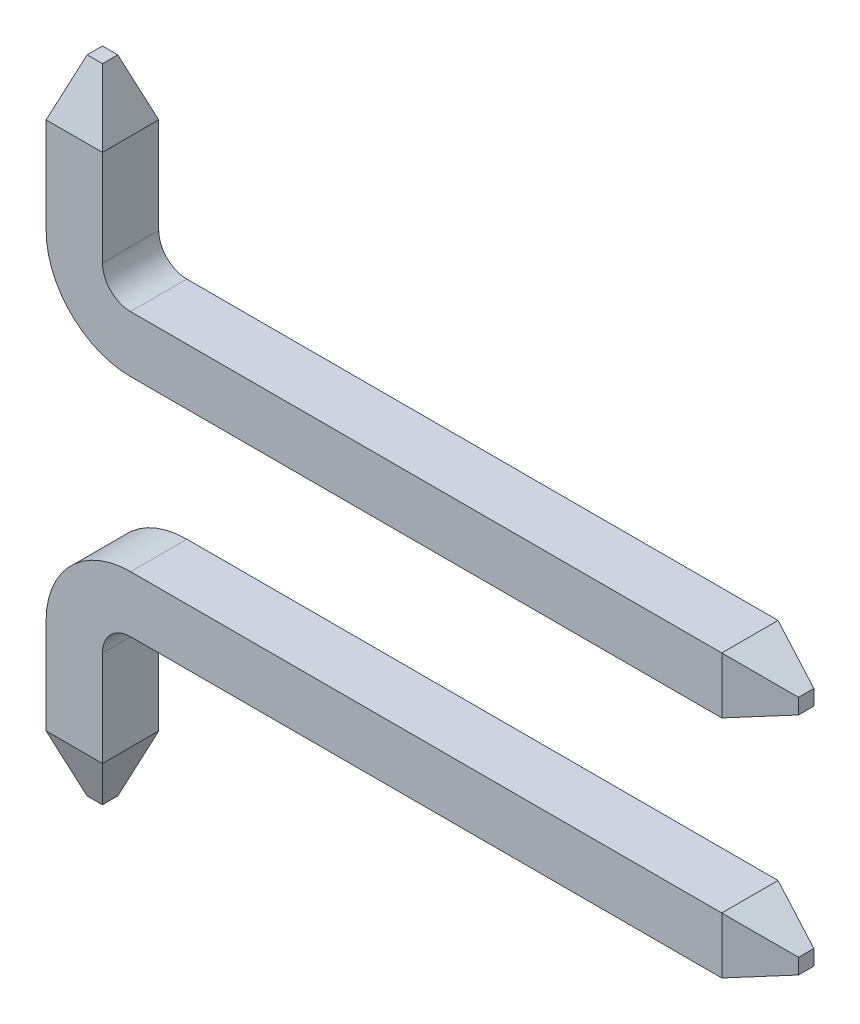
ISO-10303-21;
HEADER;
FILE_DESCRIPTION(('STEP AP214'),'2;1');
FILE_NAME('part.step','',(''),(''),'','','');
FILE_SCHEMA(('AUTOMOTIVE_DESIGN { 1 0 10303 214 1 1 1 1 }'));
ENDSEC;
DATA;
#1=APPLICATION_CONTEXT('core data for automotive mechanical design processes');
#2=APPLICATION_PROTOCOL_DEFINITION('international standard','automotive_design',2000,#1);
#3=PRODUCT_CONTEXT('',#1,'mechanical');
#4=PRODUCT('Part','Part','',(#3));
#5=PRODUCT_RELATED_PRODUCT_CATEGORY('part','',(#4));
#6=PRODUCT_DEFINITION_FORMATION('','',#4);
#7=PRODUCT_DEFINITION_CONTEXT('part definition',#1,'design');
#8=PRODUCT_DEFINITION('design','',#6,#7);
#9=PRODUCT_DEFINITION_SHAPE('','',#8);
#10=(LENGTH_UNIT() NAMED_UNIT(*) SI_UNIT(.MILLI.,.METRE.));
#11=(NAMED_UNIT(*) PLANE_ANGLE_UNIT() SI_UNIT($,.RADIAN.));
#12=(NAMED_UNIT(*) SI_UNIT($,.STERADIAN.) SOLID_ANGLE_UNIT());
#13=UNCERTAINTY_MEASURE_WITH_UNIT(LENGTH_MEASURE(1.E-05),#10,'distance_accuracy_value','');
#14=(GEOMETRIC_REPRESENTATION_CONTEXT(3) GLOBAL_UNCERTAINTY_ASSIGNED_CONTEXT((#13)) GLOBAL_UNIT_ASSIGNED_CONTEXT((#10,
#11,#12)) REPRESENTATION_CONTEXT('',''));
#15=CARTESIAN_POINT('',(0.,0.,0.));
#16=DIRECTION('',(0.,0.,1.));
#17=DIRECTION('',(1.,0.,0.));
#18=AXIS2_PLACEMENT_3D('',#15,#16,#17);
#19=CARTESIAN_POINT('',(0.75,3.6,0.));
#20=DIRECTION('',(0.,1.,0.));
#21=DIRECTION('',(0.,0.,-1.));
#22=AXIS2_PLACEMENT_3D('',#19,#20,#21);
#23=PLANE('',#22);
#24=DIRECTION('',(0.,0.,-1.));
#25=VECTOR('',#24,1.);
#26=CARTESIAN_POINT('',(0.75,3.6,0.));
#27=LINE('',#26,#25);
#28=CARTESIAN_POINT('',(0.75,3.6,0.));
#29=VERTEX_POINT('',#28);
#30=CARTESIAN_POINT('',(0.75,3.6,-0.5));
#31=VERTEX_POINT('',#30);
#32=EDGE_CURVE('E191',#29,#31,#27,.T.);
#33=ORIENTED_EDGE('',*,*,#32,.F.);
#34=DIRECTION('',(1.,0.,0.));
#35=VECTOR('',#34,1.);
#36=CARTESIAN_POINT('',(0.75,3.6,0.));
#37=LINE('',#36,#35);
#38=CARTESIAN_POINT('',(6.,3.6,0.));
#39=VERTEX_POINT('',#38);
#40=EDGE_CURVE('E51',#29,#39,#37,.T.);
#41=ORIENTED_EDGE('',*,*,#40,.T.);
#42=DIRECTION('',(0.,0.,-1.));
#43=VECTOR('',#42,1.);
#44=CARTESIAN_POINT('',(6.,3.6,0.));
#45=LINE('',#44,#43);
#46=CARTESIAN_POINT('',(6.,3.6,-0.5));
#47=VERTEX_POINT('',#46);
#48=EDGE_CURVE('E207',#39,#47,#45,.T.);
#49=ORIENTED_EDGE('',*,*,#48,.T.);
#50=DIRECTION('',(1.,0.,0.));
#51=VECTOR('',#50,1.);
#52=CARTESIAN_POINT('',(0.75,3.6,-0.5));
#53=LINE('',#52,#51);
#54=EDGE_CURVE('E215',#31,#47,#53,.T.);
#55=ORIENTED_EDGE('',*,*,#54,.F.);
#56=EDGE_LOOP('',(#33,#41,#49,#55));
#57=FACE_BOUND('',#56,.T.);
#58=ADVANCED_FACE('F44',(#57),#23,.T.);
#59=CARTESIAN_POINT('',(0.75,3.1,0.));
#60=DIRECTION('',(0.,-1.,0.));
#61=DIRECTION('',(0.,0.,1.));
#62=AXIS2_PLACEMENT_3D('',#59,#60,#61);
#63=PLANE('',#62);
#64=DIRECTION('',(0.,0.,1.));
#65=VECTOR('',#64,1.);
#66=CARTESIAN_POINT('',(0.75,3.1,0.));
#67=LINE('',#66,#65);
#68=CARTESIAN_POINT('',(0.75,3.1,-0.5));
#69=VERTEX_POINT('',#68);
#70=CARTESIAN_POINT('',(0.75,3.1,0.));
#71=VERTEX_POINT('',#70);
#72=EDGE_CURVE('E188',#69,#71,#67,.T.);
#73=ORIENTED_EDGE('',*,*,#72,.F.);
#74=DIRECTION('',(1.,0.,0.));
#75=VECTOR('',#74,1.);
#76=CARTESIAN_POINT('',(0.75,3.1,-0.5));
#77=LINE('',#76,#75);
#78=CARTESIAN_POINT('',(6.,3.1,-0.5));
#79=VERTEX_POINT('',#78);
#80=EDGE_CURVE('E212',#69,#79,#77,.T.);
#81=ORIENTED_EDGE('',*,*,#80,.T.);
#82=DIRECTION('',(0.,0.,1.));
#83=VECTOR('',#82,1.);
#84=CARTESIAN_POINT('',(6.,3.1,0.));
#85=LINE('',#84,#83);
#86=CARTESIAN_POINT('',(6.,3.1,0.));
#87=VERTEX_POINT('',#86);
#88=EDGE_CURVE('E201',#79,#87,#85,.T.);
#89=ORIENTED_EDGE('',*,*,#88,.T.);
#90=DIRECTION('',(1.,0.,0.));
#91=VECTOR('',#90,1.);
#92=CARTESIAN_POINT('',(0.75,3.1,0.));
#93=LINE('',#92,#91);
#94=EDGE_CURVE('E12',#71,#87,#93,.T.);
#95=ORIENTED_EDGE('',*,*,#94,.F.);
#96=EDGE_LOOP('',(#73,#81,#89,#95));
#97=FACE_BOUND('',#96,.T.);
#98=ADVANCED_FACE('F285',(#97),#63,.T.);
#99=CARTESIAN_POINT('',(0.75,3.85,0.));
#100=DIRECTION('',(0.,0.,-1.));
#101=DIRECTION('',(-1.,0.,0.));
#102=AXIS2_PLACEMENT_3D('',#99,#100,#101);
#103=CYLINDRICAL_SURFACE('',#102,0.25);
#104=DIRECTION('',(0.,0.,-1.));
#105=VECTOR('',#104,1.);
#106=CARTESIAN_POINT('',(0.5,3.85,0.));
#107=LINE('',#106,#105);
#108=CARTESIAN_POINT('',(0.5,3.85,0.));
#109=VERTEX_POINT('',#108);
#110=CARTESIAN_POINT('',(0.5,3.85,-0.5));
#111=VERTEX_POINT('',#110);
#112=EDGE_CURVE('E167',#109,#111,#107,.T.);
#113=ORIENTED_EDGE('',*,*,#112,.F.);
#114=CARTESIAN_POINT('',(0.75,3.85,0.));
#115=DIRECTION('',(0.,0.,1.));
#116=DIRECTION('',(-1.,0.,0.));
#117=AXIS2_PLACEMENT_3D('',#114,#115,#116);
#118=CIRCLE('',#117,0.25);
#119=EDGE_CURVE('E197',#109,#29,#118,.T.);
#120=ORIENTED_EDGE('',*,*,#119,.T.);
#121=ORIENTED_EDGE('',*,*,#32,.T.);
#122=CARTESIAN_POINT('',(0.75,3.85,-0.5));
#123=DIRECTION('',(0.,0.,1.));
#124=DIRECTION('',(-1.,0.,0.));
#125=AXIS2_PLACEMENT_3D('',#122,#123,#124);
#126=CIRCLE('',#125,0.25);
#127=EDGE_CURVE('E195',#111,#31,#126,.T.);
#128=ORIENTED_EDGE('',*,*,#127,.F.);
#129=EDGE_LOOP('',(#113,#120,#121,#128));
#130=FACE_BOUND('',#129,.T.);
#131=ADVANCED_FACE('F243',(#130),#103,.F.);
#132=CARTESIAN_POINT('',(0.75,3.85,0.));
#133=DIRECTION('',(0.,0.,-1.));
#134=DIRECTION('',(-1.,0.,0.));
#135=AXIS2_PLACEMENT_3D('',#132,#133,#134);
#136=CYLINDRICAL_SURFACE('',#135,0.75);
#137=DIRECTION('',(0.,0.,1.));
#138=VECTOR('',#137,1.);
#139=CARTESIAN_POINT('',(0.,3.85,0.));
#140=LINE('',#139,#138);
#141=CARTESIAN_POINT('',(0.,3.85,-0.5));
#142=VERTEX_POINT('',#141);
#143=CARTESIAN_POINT('',(0.,3.85,0.));
#144=VERTEX_POINT('',#143);
#145=EDGE_CURVE('E155',#142,#144,#140,.T.);
#146=ORIENTED_EDGE('',*,*,#145,.F.);
#147=CARTESIAN_POINT('',(0.75,3.85,-0.5));
#148=DIRECTION('',(0.,0.,1.));
#149=DIRECTION('',(-1.,0.,0.));
#150=AXIS2_PLACEMENT_3D('',#147,#148,#149);
#151=CIRCLE('',#150,0.75);
#152=EDGE_CURVE('E162',#142,#69,#151,.T.);
#153=ORIENTED_EDGE('',*,*,#152,.T.);
#154=ORIENTED_EDGE('',*,*,#72,.T.);
#155=CARTESIAN_POINT('',(0.75,3.85,0.));
#156=DIRECTION('',(0.,0.,1.));
#157=DIRECTION('',(-1.,0.,0.));
#158=AXIS2_PLACEMENT_3D('',#155,#156,#157);
#159=CIRCLE('',#158,0.75);
#160=EDGE_CURVE('E199',#144,#71,#159,.T.);
#161=ORIENTED_EDGE('',*,*,#160,.F.);
#162=EDGE_LOOP('',(#146,#153,#154,#161));
#163=FACE_BOUND('',#162,.T.);
#164=ADVANCED_FACE('F293',(#163),#136,.T.);
#165=CARTESIAN_POINT('',(0.,3.85,0.));
#166=DIRECTION('',(1.,0.,0.));
#167=DIRECTION('',(0.,0.,-1.));
#168=AXIS2_PLACEMENT_3D('',#165,#166,#167);
#169=PLANE('',#168);
#170=DIRECTION('',(0.,0.,1.));
#171=VECTOR('',#170,1.);
#172=CARTESIAN_POINT('',(0.,4.7,0.));
#173=LINE('',#172,#171);
#174=CARTESIAN_POINT('',(0.,4.7,-0.5));
#175=VERTEX_POINT('',#174);
#176=CARTESIAN_POINT('',(0.,4.7,0.));
#177=VERTEX_POINT('',#176);
#178=EDGE_CURVE('E140',#175,#177,#173,.T.);
#179=ORIENTED_EDGE('',*,*,#178,.F.);
#180=DIRECTION('',(0.,1.,0.));
#181=VECTOR('',#180,1.);
#182=CARTESIAN_POINT('',(0.,3.85,-0.5));
#183=LINE('',#182,#181);
#184=EDGE_CURVE('E159',#142,#175,#183,.T.);
#185=ORIENTED_EDGE('',*,*,#184,.F.);
#186=ORIENTED_EDGE('',*,*,#145,.T.);
#187=DIRECTION('',(0.,1.,0.));
#188=VECTOR('',#187,1.);
#189=CARTESIAN_POINT('',(0.,3.85,0.));
#190=LINE('',#189,#188);
#191=EDGE_CURVE('E171',#144,#177,#190,.T.);
#192=ORIENTED_EDGE('',*,*,#191,.T.);
#193=EDGE_LOOP('',(#179,#185,#186,#192));
#194=FACE_BOUND('',#193,.T.);
#195=ADVANCED_FACE('F170',(#194),#169,.F.);
#196=CARTESIAN_POINT('',(0.,3.85,0.));
#197=DIRECTION('',(0.,0.,-1.));
#198=DIRECTION('',(-1.,0.,0.));
#199=AXIS2_PLACEMENT_3D('',#196,#197,#198);
#200=PLANE('',#199);
#201=DIRECTION('',(1.,0.,0.));
#202=VECTOR('',#201,1.);
#203=CARTESIAN_POINT('',(0.,4.7,0.));
#204=LINE('',#203,#202);
#205=CARTESIAN_POINT('',(0.5,4.7,0.));
#206=VERTEX_POINT('',#205);
#207=EDGE_CURVE('E172',#177,#206,#204,.T.);
#208=ORIENTED_EDGE('',*,*,#207,.F.);
#209=ORIENTED_EDGE('',*,*,#191,.F.);
#210=ORIENTED_EDGE('',*,*,#160,.T.);
#211=ORIENTED_EDGE('',*,*,#94,.T.);
#212=DIRECTION('',(0.,1.,0.));
#213=VECTOR('',#212,1.);
#214=CARTESIAN_POINT('',(6.,3.1,0.));
#215=LINE('',#214,#213);
#216=EDGE_CURVE('E210',#87,#39,#215,.T.);
#217=ORIENTED_EDGE('',*,*,#216,.T.);
#218=ORIENTED_EDGE('',*,*,#40,.F.);
#219=ORIENTED_EDGE('',*,*,#119,.F.);
#220=DIRECTION('',(0.,1.,0.));
#221=VECTOR('',#220,1.);
#222=CARTESIAN_POINT('',(0.5,3.85,0.));
#223=LINE('',#222,#221);
#224=EDGE_CURVE('E184',#109,#206,#223,.T.);
#225=ORIENTED_EDGE('',*,*,#224,.T.);
#226=EDGE_LOOP('',(#208,#209,#210,#211,#217,#218,#219,#225));
#227=FACE_BOUND('',#226,.T.);
#228=ADVANCED_FACE('F226',(#227),#200,.F.);
#229=CARTESIAN_POINT('',(0.5,3.85,0.));
#230=DIRECTION('',(-1.,0.,0.));
#231=DIRECTION('',(0.,0.,1.));
#232=AXIS2_PLACEMENT_3D('',#229,#230,#231);
#233=PLANE('',#232);
#234=DIRECTION('',(0.,0.,-1.));
#235=VECTOR('',#234,1.);
#236=CARTESIAN_POINT('',(0.5,4.7,0.));
#237=LINE('',#236,#235);
#238=CARTESIAN_POINT('',(0.5,4.7,-0.5));
#239=VERTEX_POINT('',#238);
#240=EDGE_CURVE('E156',#206,#239,#237,.T.);
#241=ORIENTED_EDGE('',*,*,#240,.F.);
#242=ORIENTED_EDGE('',*,*,#224,.F.);
#243=ORIENTED_EDGE('',*,*,#112,.T.);
#244=DIRECTION('',(0.,1.,0.));
#245=VECTOR('',#244,1.);
#246=CARTESIAN_POINT('',(0.5,3.85,-0.5));
#247=LINE('',#246,#245);
#248=EDGE_CURVE('E166',#111,#239,#247,.T.);
#249=ORIENTED_EDGE('',*,*,#248,.T.);
#250=EDGE_LOOP('',(#241,#242,#243,#249));
#251=FACE_BOUND('',#250,.T.);
#252=ADVANCED_FACE('F272',(#251),#233,.F.);
#253=CARTESIAN_POINT('',(0.,3.85,-0.5));
#254=DIRECTION('',(0.,0.,1.));
#255=DIRECTION('',(1.,0.,0.));
#256=AXIS2_PLACEMENT_3D('',#253,#254,#255);
#257=PLANE('',#256);
#258=DIRECTION('',(-1.,0.,0.));
#259=VECTOR('',#258,1.);
#260=CARTESIAN_POINT('',(0.,4.7,-0.5));
#261=LINE('',#260,#259);
#262=EDGE_CURVE('E149',#239,#175,#261,.T.);
#263=ORIENTED_EDGE('',*,*,#262,.F.);
#264=ORIENTED_EDGE('',*,*,#248,.F.);
#265=ORIENTED_EDGE('',*,*,#127,.T.);
#266=ORIENTED_EDGE('',*,*,#54,.T.);
#267=DIRECTION('',(0.,-1.,0.));
#268=VECTOR('',#267,1.);
#269=CARTESIAN_POINT('',(6.,3.1,-0.5));
#270=LINE('',#269,#268);
#271=EDGE_CURVE('E204',#47,#79,#270,.T.);
#272=ORIENTED_EDGE('',*,*,#271,.T.);
#273=ORIENTED_EDGE('',*,*,#80,.F.);
#274=ORIENTED_EDGE('',*,*,#152,.F.);
#275=ORIENTED_EDGE('',*,*,#184,.T.);
#276=EDGE_LOOP('',(#263,#264,#265,#266,#272,#273,#274,#275));
#277=FACE_BOUND('',#276,.T.);
#278=ADVANCED_FACE('F160',(#277),#257,.F.);
#279=CARTESIAN_POINT('',(6.,3.1,0.));
#280=DIRECTION('',(0.342020143325669,0.,0.939692620785908));
#281=DIRECTION('',(0.939692620785909,0.,-0.342020143325669));
#282=AXIS2_PLACEMENT_3D('',#279,#280,#281);
#283=PLANE('',#282);
#284=ORIENTED_EDGE('',*,*,#216,.F.);
#285=DIRECTION('',(-0.889126490715988,-0.323615577118184,0.323615577118185));
#286=VECTOR('',#285,1.);
#287=CARTESIAN_POINT('',(6.,3.1,0.));
#288=LINE('',#287,#286);
#289=CARTESIAN_POINT('',(6.5,3.2819851171331,-0.181985117133101));
#290=VERTEX_POINT('',#289);
#291=EDGE_CURVE('E58',#290,#87,#288,.T.);
#292=ORIENTED_EDGE('',*,*,#291,.F.);
#293=DIRECTION('',(0.,-1.,0.));
#294=VECTOR('',#293,1.);
#295=CARTESIAN_POINT('',(6.5,3.1,-0.181985117133101));
#296=LINE('',#295,#294);
#297=CARTESIAN_POINT('',(6.5,3.4180148828669,-0.181985117133101));
#298=VERTEX_POINT('',#297);
#299=EDGE_CURVE('E145',#290,#298,#296,.F.);
#300=ORIENTED_EDGE('',*,*,#299,.T.);
#301=DIRECTION('',(-0.889126490715988,0.323615577118185,0.323615577118185));
#302=VECTOR('',#301,1.);
#303=CARTESIAN_POINT('',(6.,3.6,0.));
#304=LINE('',#303,#302);
#305=EDGE_CURVE('E65',#298,#39,#304,.T.);
#306=ORIENTED_EDGE('',*,*,#305,.T.);
#307=EDGE_LOOP('',(#284,#292,#300,#306));
#308=FACE_BOUND('',#307,.T.);
#309=ADVANCED_FACE('F308',(#308),#283,.T.);
#310=CARTESIAN_POINT('',(6.,3.6,0.));
#311=DIRECTION('',(0.342020143325669,0.939692620785908,0.));
#312=DIRECTION('',(0.939692620785908,-0.342020143325669,0.));
#313=AXIS2_PLACEMENT_3D('',#310,#311,#312);
#314=PLANE('',#313);
#315=ORIENTED_EDGE('',*,*,#48,.F.);
#316=ORIENTED_EDGE('',*,*,#305,.F.);
#317=DIRECTION('',(0.,0.,1.));
#318=VECTOR('',#317,1.);
#319=CARTESIAN_POINT('',(6.5,3.4180148828669,0.));
#320=LINE('',#319,#318);
#321=CARTESIAN_POINT('',(6.5,3.4180148828669,-0.318014882866899));
#322=VERTEX_POINT('',#321);
#323=EDGE_CURVE('E234',#298,#322,#320,.F.);
#324=ORIENTED_EDGE('',*,*,#323,.T.);
#325=DIRECTION('',(-0.889126490715988,0.323615577118185,-0.323615577118185));
#326=VECTOR('',#325,1.);
#327=CARTESIAN_POINT('',(6.14386759121206,3.54763647912323,-0.447636479123232));
#328=LINE('',#327,#326);
#329=EDGE_CURVE('E176',#322,#47,#328,.T.);
#330=ORIENTED_EDGE('',*,*,#329,.T.);
#331=EDGE_LOOP('',(#315,#316,#324,#330));
#332=FACE_BOUND('',#331,.T.);
#333=ADVANCED_FACE('F230',(#332),#314,.T.);
#334=CARTESIAN_POINT('',(6.,3.1,-0.5));
#335=DIRECTION('',(0.342020143325669,0.,-0.939692620785908));
#336=DIRECTION('',(-0.939692620785909,0.,-0.342020143325669));
#337=AXIS2_PLACEMENT_3D('',#334,#335,#336);
#338=PLANE('',#337);
#339=ORIENTED_EDGE('',*,*,#271,.F.);
#340=ORIENTED_EDGE('',*,*,#329,.F.);
#341=DIRECTION('',(0.,1.,0.));
#342=VECTOR('',#341,1.);
#343=CARTESIAN_POINT('',(6.5,3.1,-0.318014882866899));
#344=LINE('',#343,#342);
#345=CARTESIAN_POINT('',(6.5,3.2819851171331,-0.318014882866899));
#346=VERTEX_POINT('',#345);
#347=EDGE_CURVE('E249',#322,#346,#344,.F.);
#348=ORIENTED_EDGE('',*,*,#347,.T.);
#349=DIRECTION('',(-0.889126490715988,-0.323615577118184,-0.323615577118185));
#350=VECTOR('',#349,1.);
#351=CARTESIAN_POINT('',(6.14386759121206,3.15236352087677,-0.447636479123232));
#352=LINE('',#351,#350);
#353=EDGE_CURVE('E237',#346,#79,#352,.T.);
#354=ORIENTED_EDGE('',*,*,#353,.T.);
#355=EDGE_LOOP('',(#339,#340,#348,#354));
#356=FACE_BOUND('',#355,.T.);
#357=ADVANCED_FACE('F239',(#356),#338,.T.);
#358=CARTESIAN_POINT('',(6.,3.1,0.));
#359=DIRECTION('',(0.342020143325668,-0.939692620785909,0.));
#360=DIRECTION('',(-0.939692620785909,-0.342020143325668,0.));
#361=AXIS2_PLACEMENT_3D('',#358,#359,#360);
#362=PLANE('',#361);
#363=ORIENTED_EDGE('',*,*,#88,.F.);
#364=ORIENTED_EDGE('',*,*,#353,.F.);
#365=DIRECTION('',(0.,0.,-1.));
#366=VECTOR('',#365,1.);
#367=CARTESIAN_POINT('',(6.5,3.2819851171331,0.));
#368=LINE('',#367,#366);
#369=EDGE_CURVE('E247',#346,#290,#368,.F.);
#370=ORIENTED_EDGE('',*,*,#369,.T.);
#371=ORIENTED_EDGE('',*,*,#291,.T.);
#372=EDGE_LOOP('',(#363,#364,#370,#371));
#373=FACE_BOUND('',#372,.T.);
#374=ADVANCED_FACE('F313',(#373),#362,.T.);
#375=CARTESIAN_POINT('',(6.5,3.6,0.));
#376=DIRECTION('',(1.,0.,0.));
#377=DIRECTION('',(0.,0.,-1.));
#378=AXIS2_PLACEMENT_3D('',#375,#376,#377);
#379=PLANE('',#378);
#380=ORIENTED_EDGE('',*,*,#299,.F.);
#381=ORIENTED_EDGE('',*,*,#369,.F.);
#382=ORIENTED_EDGE('',*,*,#347,.F.);
#383=ORIENTED_EDGE('',*,*,#323,.F.);
#384=EDGE_LOOP('',(#380,#381,#382,#383));
#385=FACE_BOUND('',#384,.T.);
#386=ADVANCED_FACE('F316',(#385),#379,.T.);
#387=CARTESIAN_POINT('',(0.,4.7,0.));
#388=DIRECTION('',(-0.939692620785908,0.342020143325669,0.));
#389=DIRECTION('',(0.342020143325669,0.939692620785909,0.));
#390=AXIS2_PLACEMENT_3D('',#387,#388,#389);
#391=PLANE('',#390);
#392=ORIENTED_EDGE('',*,*,#178,.T.);
#393=DIRECTION('',(-0.323615577118185,-0.889126490715988,0.323615577118185));
#394=VECTOR('',#393,1.);
#395=CARTESIAN_POINT('',(0.,4.7,0.));
#396=LINE('',#395,#394);
#397=CARTESIAN_POINT('',(0.181985117133101,5.2,-0.181985117133101));
#398=VERTEX_POINT('',#397);
#399=EDGE_CURVE('E257',#398,#177,#396,.T.);
#400=ORIENTED_EDGE('',*,*,#399,.F.);
#401=DIRECTION('',(0.,0.,1.));
#402=VECTOR('',#401,1.);
#403=CARTESIAN_POINT('',(0.181985117133101,5.2,0.));
#404=LINE('',#403,#402);
#405=CARTESIAN_POINT('',(0.181985117133101,5.2,-0.318014882866899));
#406=VERTEX_POINT('',#405);
#407=EDGE_CURVE('E142',#398,#406,#404,.F.);
#408=ORIENTED_EDGE('',*,*,#407,.T.);
#409=DIRECTION('',(-0.323615577118185,-0.889126490715988,-0.323615577118185));
#410=VECTOR('',#409,1.);
#411=CARTESIAN_POINT('',(0.,4.7,-0.5));
#412=LINE('',#411,#410);
#413=EDGE_CURVE('E135',#406,#175,#412,.T.);
#414=ORIENTED_EDGE('',*,*,#413,.T.);
#415=EDGE_LOOP('',(#392,#400,#408,#414));
#416=FACE_BOUND('',#415,.T.);
#417=ADVANCED_FACE('F137',(#416),#391,.T.);
#418=CARTESIAN_POINT('',(0.,4.7,-0.5));
#419=DIRECTION('',(0.,0.342020143325669,-0.939692620785908));
#420=DIRECTION('',(0.,-0.939692620785909,-0.342020143325669));
#421=AXIS2_PLACEMENT_3D('',#418,#419,#420);
#422=PLANE('',#421);
#423=ORIENTED_EDGE('',*,*,#262,.T.);
#424=ORIENTED_EDGE('',*,*,#413,.F.);
#425=DIRECTION('',(-1.,0.,0.));
#426=VECTOR('',#425,1.);
#427=CARTESIAN_POINT('',(0.,5.2,-0.318014882866899));
#428=LINE('',#427,#426);
#429=CARTESIAN_POINT('',(0.318014882866899,5.2,-0.318014882866899));
#430=VERTEX_POINT('',#429);
#431=EDGE_CURVE('E261',#406,#430,#428,.F.);
#432=ORIENTED_EDGE('',*,*,#431,.T.);
#433=DIRECTION('',(0.323615577118185,-0.889126490715988,-0.323615577118185));
#434=VECTOR('',#433,1.);
#435=CARTESIAN_POINT('',(0.447636479123232,4.84386759121206,-0.447636479123232));
#436=LINE('',#435,#434);
#437=EDGE_CURVE('E146',#430,#239,#436,.T.);
#438=ORIENTED_EDGE('',*,*,#437,.T.);
#439=EDGE_LOOP('',(#423,#424,#432,#438));
#440=FACE_BOUND('',#439,.T.);
#441=ADVANCED_FACE('F151',(#440),#422,.T.);
#442=CARTESIAN_POINT('',(0.5,4.7,0.));
#443=DIRECTION('',(0.939692620785908,0.342020143325669,0.));
#444=DIRECTION('',(0.342020143325669,-0.939692620785909,0.));
#445=AXIS2_PLACEMENT_3D('',#442,#443,#444);
#446=PLANE('',#445);
#447=ORIENTED_EDGE('',*,*,#240,.T.);
#448=ORIENTED_EDGE('',*,*,#437,.F.);
#449=DIRECTION('',(0.,0.,-1.));
#450=VECTOR('',#449,1.);
#451=CARTESIAN_POINT('',(0.318014882866899,5.2,0.));
#452=LINE('',#451,#450);
#453=CARTESIAN_POINT('',(0.318014882866899,5.2,-0.181985117133101));
#454=VERTEX_POINT('',#453);
#455=EDGE_CURVE('E258',#430,#454,#452,.F.);
#456=ORIENTED_EDGE('',*,*,#455,.T.);
#457=DIRECTION('',(0.323615577118185,-0.889126490715988,0.323615577118185));
#458=VECTOR('',#457,1.);
#459=CARTESIAN_POINT('',(0.447636479123232,4.84386759121206,-0.052363520876768));
#460=LINE('',#459,#458);
#461=EDGE_CURVE('E265',#454,#206,#460,.T.);
#462=ORIENTED_EDGE('',*,*,#461,.T.);
#463=EDGE_LOOP('',(#447,#448,#456,#462));
#464=FACE_BOUND('',#463,.T.);
#465=ADVANCED_FACE('F274',(#464),#446,.T.);
#466=CARTESIAN_POINT('',(0.,4.7,0.));
#467=DIRECTION('',(0.,0.342020143325669,0.939692620785908));
#468=DIRECTION('',(0.,0.939692620785909,-0.342020143325669));
#469=AXIS2_PLACEMENT_3D('',#466,#467,#468);
#470=PLANE('',#469);
#471=ORIENTED_EDGE('',*,*,#207,.T.);
#472=ORIENTED_EDGE('',*,*,#461,.F.);
#473=DIRECTION('',(1.,0.,0.));
#474=VECTOR('',#473,1.);
#475=CARTESIAN_POINT('',(0.,5.2,-0.181985117133101));
#476=LINE('',#475,#474);
#477=EDGE_CURVE('E255',#454,#398,#476,.F.);
#478=ORIENTED_EDGE('',*,*,#477,.T.);
#479=ORIENTED_EDGE('',*,*,#399,.T.);
#480=EDGE_LOOP('',(#471,#472,#478,#479));
#481=FACE_BOUND('',#480,.T.);
#482=ADVANCED_FACE('F268',(#481),#470,.T.);
#483=CARTESIAN_POINT('',(0.,5.2,-0.5));
#484=DIRECTION('',(0.,1.,0.));
#485=DIRECTION('',(0.,0.,-1.));
#486=AXIS2_PLACEMENT_3D('',#483,#484,#485);
#487=PLANE('',#486);
#488=ORIENTED_EDGE('',*,*,#407,.F.);
#489=ORIENTED_EDGE('',*,*,#477,.F.);
#490=ORIENTED_EDGE('',*,*,#455,.F.);
#491=ORIENTED_EDGE('',*,*,#431,.F.);
#492=EDGE_LOOP('',(#488,#489,#490,#491));
#493=FACE_BOUND('',#492,.T.);
#494=ADVANCED_FACE('F276',(#493),#487,.T.);
#495=CLOSED_SHELL('',(#58,#98,#131,#164,#195,#228,#252,#278,#309,#333,#357,#374,#386,#417,#441,
#465,#482,#494));
#496=MANIFOLD_SOLID_BREP('B2',#495);
#497=CARTESIAN_POINT('',(0.75,1.1,0.));
#498=DIRECTION('',(0.,-1.,0.));
#499=DIRECTION('',(0.,0.,-1.));
#500=AXIS2_PLACEMENT_3D('',#497,#498,#499);
#501=PLANE('',#500);
#502=DIRECTION('',(0.,0.,-1.));
#503=VECTOR('',#502,1.);
#504=CARTESIAN_POINT('',(0.75,1.1,0.));
#505=LINE('',#504,#503);
#506=CARTESIAN_POINT('',(0.75,1.1,0.));
#507=VERTEX_POINT('',#506);
#508=CARTESIAN_POINT('',(0.75,1.1,-0.5));
#509=VERTEX_POINT('',#508);
#510=EDGE_CURVE('E622',#507,#509,#505,.T.);
#511=ORIENTED_EDGE('',*,*,#510,.T.);
#512=DIRECTION('',(1.,0.,0.));
#513=VECTOR('',#512,1.);
#514=CARTESIAN_POINT('',(0.75,1.1,-0.5));
#515=LINE('',#514,#513);
#516=CARTESIAN_POINT('',(6.,1.1,-0.5));
#517=VERTEX_POINT('',#516);
#518=EDGE_CURVE('E646',#509,#517,#515,.T.);
#519=ORIENTED_EDGE('',*,*,#518,.T.);
#520=DIRECTION('',(0.,0.,-1.));
#521=VECTOR('',#520,1.);
#522=CARTESIAN_POINT('',(6.,1.1,0.));
#523=LINE('',#522,#521);
#524=CARTESIAN_POINT('',(6.,1.1,0.));
#525=VERTEX_POINT('',#524);
#526=EDGE_CURVE('E500',#525,#517,#523,.T.);
#527=ORIENTED_EDGE('',*,*,#526,.F.);
#528=DIRECTION('',(1.,0.,0.));
#529=VECTOR('',#528,1.);
#530=CARTESIAN_POINT('',(0.75,1.1,0.));
#531=LINE('',#530,#529);
#532=EDGE_CURVE('E486',#507,#525,#531,.T.);
#533=ORIENTED_EDGE('',*,*,#532,.F.);
#534=EDGE_LOOP('',(#511,#519,#527,#533));
#535=FACE_BOUND('',#534,.T.);
#536=ADVANCED_FACE('F479',(#535),#501,.T.);
#537=CARTESIAN_POINT('',(0.75,1.6,0.));
#538=DIRECTION('',(0.,1.,0.));
#539=DIRECTION('',(0.,0.,1.));
#540=AXIS2_PLACEMENT_3D('',#537,#538,#539);
#541=PLANE('',#540);
#542=DIRECTION('',(0.,0.,1.));
#543=VECTOR('',#542,1.);
#544=CARTESIAN_POINT('',(0.75,1.6,0.));
#545=LINE('',#544,#543);
#546=CARTESIAN_POINT('',(0.75,1.6,-0.5));
#547=VERTEX_POINT('',#546);
#548=CARTESIAN_POINT('',(0.75,1.6,0.));
#549=VERTEX_POINT('',#548);
#550=EDGE_CURVE('E619',#547,#549,#545,.T.);
#551=ORIENTED_EDGE('',*,*,#550,.T.);
#552=DIRECTION('',(1.,0.,0.));
#553=VECTOR('',#552,1.);
#554=CARTESIAN_POINT('',(0.75,1.6,0.));
#555=LINE('',#554,#553);
#556=CARTESIAN_POINT('',(6.,1.6,0.));
#557=VERTEX_POINT('',#556);
#558=EDGE_CURVE('E42',#549,#557,#555,.T.);
#559=ORIENTED_EDGE('',*,*,#558,.T.);
#560=DIRECTION('',(0.,0.,1.));
#561=VECTOR('',#560,1.);
#562=CARTESIAN_POINT('',(6.,1.6,0.));
#563=LINE('',#562,#561);
#564=CARTESIAN_POINT('',(6.,1.6,-0.5));
#565=VERTEX_POINT('',#564);
#566=EDGE_CURVE('E636',#565,#557,#563,.T.);
#567=ORIENTED_EDGE('',*,*,#566,.F.);
#568=DIRECTION('',(1.,0.,0.));
#569=VECTOR('',#568,1.);
#570=CARTESIAN_POINT('',(0.75,1.6,-0.5));
#571=LINE('',#570,#569);
#572=EDGE_CURVE('E644',#547,#565,#571,.T.);
#573=ORIENTED_EDGE('',*,*,#572,.F.);
#574=EDGE_LOOP('',(#551,#559,#567,#573));
#575=FACE_BOUND('',#574,.T.);
#576=ADVANCED_FACE('F715',(#575),#541,.T.);
#577=CARTESIAN_POINT('',(0.75,0.85,0.));
#578=DIRECTION('',(0.,0.,-1.));
#579=DIRECTION('',(-1.,0.,0.));
#580=AXIS2_PLACEMENT_3D('',#577,#578,#579);
#581=CYLINDRICAL_SURFACE('',#580,0.25);
#582=DIRECTION('',(0.,0.,-1.));
#583=VECTOR('',#582,1.);
#584=CARTESIAN_POINT('',(0.5,0.85,0.));
#585=LINE('',#584,#583);
#586=CARTESIAN_POINT('',(0.5,0.85,0.));
#587=VERTEX_POINT('',#586);
#588=CARTESIAN_POINT('',(0.5,0.85,-0.5));
#589=VERTEX_POINT('',#588);
#590=EDGE_CURVE('E607',#587,#589,#585,.T.);
#591=ORIENTED_EDGE('',*,*,#590,.T.);
#592=CARTESIAN_POINT('',(0.75,0.85,-0.5));
#593=DIRECTION('',(0.,0.,-1.));
#594=DIRECTION('',(-1.,0.,0.));
#595=AXIS2_PLACEMENT_3D('',#592,#593,#594);
#596=CIRCLE('',#595,0.25);
#597=EDGE_CURVE('E627',#589,#509,#596,.T.);
#598=ORIENTED_EDGE('',*,*,#597,.T.);
#599=ORIENTED_EDGE('',*,*,#510,.F.);
#600=CARTESIAN_POINT('',(0.75,0.85,0.));
#601=DIRECTION('',(0.,0.,-1.));
#602=DIRECTION('',(-1.,0.,0.));
#603=AXIS2_PLACEMENT_3D('',#600,#601,#602);
#604=CIRCLE('',#603,0.25);
#605=EDGE_CURVE('E630',#587,#507,#604,.T.);
#606=ORIENTED_EDGE('',*,*,#605,.F.);
#607=EDGE_LOOP('',(#591,#598,#599,#606));
#608=FACE_BOUND('',#607,.T.);
#609=ADVANCED_FACE('F719',(#608),#581,.F.);
#610=CARTESIAN_POINT('',(0.75,0.85,0.));
#611=DIRECTION('',(0.,0.,-1.));
#612=DIRECTION('',(-1.,0.,0.));
#613=AXIS2_PLACEMENT_3D('',#610,#611,#612);
#614=CYLINDRICAL_SURFACE('',#613,0.75);
#615=DIRECTION('',(0.,0.,1.));
#616=VECTOR('',#615,1.);
#617=CARTESIAN_POINT('',(0.,0.85,0.));
#618=LINE('',#617,#616);
#619=CARTESIAN_POINT('',(0.,0.85,-0.5));
#620=VERTEX_POINT('',#619);
#621=CARTESIAN_POINT('',(0.,0.85,0.));
#622=VERTEX_POINT('',#621);
#623=EDGE_CURVE('E602',#620,#622,#618,.T.);
#624=ORIENTED_EDGE('',*,*,#623,.T.);
#625=CARTESIAN_POINT('',(0.75,0.85,0.));
#626=DIRECTION('',(0.,0.,-1.));
#627=DIRECTION('',(-1.,0.,0.));
#628=AXIS2_PLACEMENT_3D('',#625,#626,#627);
#629=CIRCLE('',#628,0.75);
#630=EDGE_CURVE('E633',#622,#549,#629,.T.);
#631=ORIENTED_EDGE('',*,*,#630,.T.);
#632=ORIENTED_EDGE('',*,*,#550,.F.);
#633=CARTESIAN_POINT('',(0.75,0.85,-0.5));
#634=DIRECTION('',(0.,0.,-1.));
#635=DIRECTION('',(-1.,0.,0.));
#636=AXIS2_PLACEMENT_3D('',#633,#634,#635);
#637=CIRCLE('',#636,0.75);
#638=EDGE_CURVE('E625',#620,#547,#637,.T.);
#639=ORIENTED_EDGE('',*,*,#638,.F.);
#640=EDGE_LOOP('',(#624,#631,#632,#639));
#641=FACE_BOUND('',#640,.T.);
#642=ADVANCED_FACE('F754',(#641),#614,.T.);
#643=CARTESIAN_POINT('',(0.,0.85,0.));
#644=DIRECTION('',(1.,0.,0.));
#645=DIRECTION('',(0.,0.,-1.));
#646=AXIS2_PLACEMENT_3D('',#643,#644,#645);
#647=PLANE('',#646);
#648=DIRECTION('',(0.,0.,1.));
#649=VECTOR('',#648,1.);
#650=CARTESIAN_POINT('',(0.,0.,0.));
#651=LINE('',#650,#649);
#652=CARTESIAN_POINT('',(0.,0.,-0.5));
#653=VERTEX_POINT('',#652);
#654=CARTESIAN_POINT('',(0.,0.,0.));
#655=VERTEX_POINT('',#654);
#656=EDGE_CURVE('E582',#653,#655,#651,.T.);
#657=ORIENTED_EDGE('',*,*,#656,.T.);
#658=DIRECTION('',(0.,-1.,0.));
#659=VECTOR('',#658,1.);
#660=CARTESIAN_POINT('',(0.,0.85,0.));
#661=LINE('',#660,#659);
#662=EDGE_CURVE('E617',#622,#655,#661,.T.);
#663=ORIENTED_EDGE('',*,*,#662,.F.);
#664=ORIENTED_EDGE('',*,*,#623,.F.);
#665=DIRECTION('',(0.,-1.,0.));
#666=VECTOR('',#665,1.);
#667=CARTESIAN_POINT('',(0.,0.85,-0.5));
#668=LINE('',#667,#666);
#669=EDGE_CURVE('E598',#620,#653,#668,.T.);
#670=ORIENTED_EDGE('',*,*,#669,.T.);
#671=EDGE_LOOP('',(#657,#663,#664,#670));
#672=FACE_BOUND('',#671,.T.);
#673=ADVANCED_FACE('F605',(#672),#647,.F.);
#674=CARTESIAN_POINT('',(0.,0.85,0.));
#675=DIRECTION('',(0.,0.,-1.));
#676=DIRECTION('',(-1.,0.,0.));
#677=AXIS2_PLACEMENT_3D('',#674,#675,#676);
#678=PLANE('',#677);
#679=DIRECTION('',(1.,0.,0.));
#680=VECTOR('',#679,1.);
#681=CARTESIAN_POINT('',(0.,0.,0.));
#682=LINE('',#681,#680);
#683=CARTESIAN_POINT('',(0.5,0.,0.));
#684=VERTEX_POINT('',#683);
#685=EDGE_CURVE('E590',#655,#684,#682,.T.);
#686=ORIENTED_EDGE('',*,*,#685,.T.);
#687=DIRECTION('',(0.,-1.,0.));
#688=VECTOR('',#687,1.);
#689=CARTESIAN_POINT('',(0.5,0.85,0.));
#690=LINE('',#689,#688);
#691=EDGE_CURVE('E609',#587,#684,#690,.T.);
#692=ORIENTED_EDGE('',*,*,#691,.F.);
#693=ORIENTED_EDGE('',*,*,#605,.T.);
#694=ORIENTED_EDGE('',*,*,#532,.T.);
#695=DIRECTION('',(0.,-1.,0.));
#696=VECTOR('',#695,1.);
#697=CARTESIAN_POINT('',(6.,1.6,0.));
#698=LINE('',#697,#696);
#699=EDGE_CURVE('E493',#557,#525,#698,.T.);
#700=ORIENTED_EDGE('',*,*,#699,.F.);
#701=ORIENTED_EDGE('',*,*,#558,.F.);
#702=ORIENTED_EDGE('',*,*,#630,.F.);
#703=ORIENTED_EDGE('',*,*,#662,.T.);
#704=EDGE_LOOP('',(#686,#692,#693,#694,#700,#701,#702,#703));
#705=FACE_BOUND('',#704,.T.);
#706=ADVANCED_FACE('F649',(#705),#678,.F.);
#707=CARTESIAN_POINT('',(0.5,0.85,0.));
#708=DIRECTION('',(-1.,0.,0.));
#709=DIRECTION('',(0.,0.,1.));
#710=AXIS2_PLACEMENT_3D('',#707,#708,#709);
#711=PLANE('',#710);
#712=DIRECTION('',(0.,0.,-1.));
#713=VECTOR('',#712,1.);
#714=CARTESIAN_POINT('',(0.5,0.,0.));
#715=LINE('',#714,#713);
#716=CARTESIAN_POINT('',(0.5,0.,-0.5));
#717=VERTEX_POINT('',#716);
#718=EDGE_CURVE('E603',#684,#717,#715,.T.);
#719=ORIENTED_EDGE('',*,*,#718,.T.);
#720=DIRECTION('',(0.,-1.,0.));
#721=VECTOR('',#720,1.);
#722=CARTESIAN_POINT('',(0.5,0.85,-0.5));
#723=LINE('',#722,#721);
#724=EDGE_CURVE('E601',#589,#717,#723,.T.);
#725=ORIENTED_EDGE('',*,*,#724,.F.);
#726=ORIENTED_EDGE('',*,*,#590,.F.);
#727=ORIENTED_EDGE('',*,*,#691,.T.);
#728=EDGE_LOOP('',(#719,#725,#726,#727));
#729=FACE_BOUND('',#728,.T.);
#730=ADVANCED_FACE('F686',(#729),#711,.F.);
#731=CARTESIAN_POINT('',(0.,0.85,-0.5));
#732=DIRECTION('',(0.,0.,1.));
#733=DIRECTION('',(1.,0.,0.));
#734=AXIS2_PLACEMENT_3D('',#731,#732,#733);
#735=PLANE('',#734);
#736=DIRECTION('',(-1.,0.,0.));
#737=VECTOR('',#736,1.);
#738=CARTESIAN_POINT('',(0.,0.,-0.5));
#739=LINE('',#738,#737);
#740=EDGE_CURVE('E571',#717,#653,#739,.T.);
#741=ORIENTED_EDGE('',*,*,#740,.T.);
#742=ORIENTED_EDGE('',*,*,#669,.F.);
#743=ORIENTED_EDGE('',*,*,#638,.T.);
#744=ORIENTED_EDGE('',*,*,#572,.T.);
#745=DIRECTION('',(0.,1.,0.));
#746=VECTOR('',#745,1.);
#747=CARTESIAN_POINT('',(6.,1.6,-0.5));
#748=LINE('',#747,#746);
#749=EDGE_CURVE('E639',#517,#565,#748,.T.);
#750=ORIENTED_EDGE('',*,*,#749,.F.);
#751=ORIENTED_EDGE('',*,*,#518,.F.);
#752=ORIENTED_EDGE('',*,*,#597,.F.);
#753=ORIENTED_EDGE('',*,*,#724,.T.);
#754=EDGE_LOOP('',(#741,#742,#743,#744,#750,#751,#752,#753));
#755=FACE_BOUND('',#754,.T.);
#756=ADVANCED_FACE('F596',(#755),#735,.F.);
#757=CARTESIAN_POINT('',(6.,1.6,0.));
#758=DIRECTION('',(0.342020143325669,0.,0.939692620785908));
#759=DIRECTION('',(0.939692620785909,0.,-0.342020143325669));
#760=AXIS2_PLACEMENT_3D('',#757,#758,#759);
#761=PLANE('',#760);
#762=ORIENTED_EDGE('',*,*,#699,.T.);
#763=DIRECTION('',(-0.889126490715988,-0.323615577118185,0.323615577118185));
#764=VECTOR('',#763,1.);
#765=CARTESIAN_POINT('',(6.,1.1,0.));
#766=LINE('',#765,#764);
#767=CARTESIAN_POINT('',(6.5,1.2819851171331,-0.181985117133101));
#768=VERTEX_POINT('',#767);
#769=EDGE_CURVE('E591',#768,#525,#766,.T.);
#770=ORIENTED_EDGE('',*,*,#769,.F.);
#771=DIRECTION('',(0.,1.,0.));
#772=VECTOR('',#771,1.);
#773=CARTESIAN_POINT('',(6.5,1.6,-0.181985117133101));
#774=LINE('',#773,#772);
#775=CARTESIAN_POINT('',(6.5,1.4180148828669,-0.181985117133101));
#776=VERTEX_POINT('',#775);
#777=EDGE_CURVE('E577',#776,#768,#774,.F.);
#778=ORIENTED_EDGE('',*,*,#777,.F.);
#779=DIRECTION('',(-0.889126490715988,0.323615577118184,0.323615577118185));
#780=VECTOR('',#779,1.);
#781=CARTESIAN_POINT('',(6.,1.6,0.));
#782=LINE('',#781,#780);
#783=EDGE_CURVE('E666',#776,#557,#782,.T.);
#784=ORIENTED_EDGE('',*,*,#783,.T.);
#785=EDGE_LOOP('',(#762,#770,#778,#784));
#786=FACE_BOUND('',#785,.T.);
#787=ADVANCED_FACE('F664',(#786),#761,.T.);
#788=CARTESIAN_POINT('',(6.,1.1,0.));
#789=DIRECTION('',(0.342020143325669,-0.939692620785908,0.));
#790=DIRECTION('',(0.939692620785908,0.342020143325669,0.));
#791=AXIS2_PLACEMENT_3D('',#788,#789,#790);
#792=PLANE('',#791);
#793=ORIENTED_EDGE('',*,*,#526,.T.);
#794=DIRECTION('',(-0.889126490715988,-0.323615577118185,-0.323615577118185));
#795=VECTOR('',#794,1.);
#796=CARTESIAN_POINT('',(6.14386759121206,1.15236352087677,-0.447636479123232));
#797=LINE('',#796,#795);
#798=CARTESIAN_POINT('',(6.5,1.2819851171331,-0.318014882866899));
#799=VERTEX_POINT('',#798);
#800=EDGE_CURVE('E661',#799,#517,#797,.T.);
#801=ORIENTED_EDGE('',*,*,#800,.F.);
#802=DIRECTION('',(0.,0.,1.));
#803=VECTOR('',#802,1.);
#804=CARTESIAN_POINT('',(6.5,1.2819851171331,0.));
#805=LINE('',#804,#803);
#806=EDGE_CURVE('E657',#768,#799,#805,.F.);
#807=ORIENTED_EDGE('',*,*,#806,.F.);
#808=ORIENTED_EDGE('',*,*,#769,.T.);
#809=EDGE_LOOP('',(#793,#801,#807,#808));
#810=FACE_BOUND('',#809,.T.);
#811=ADVANCED_FACE('F654',(#810),#792,.T.);
#812=CARTESIAN_POINT('',(6.,1.6,-0.5));
#813=DIRECTION('',(0.342020143325669,0.,-0.939692620785908));
#814=DIRECTION('',(-0.939692620785909,0.,-0.342020143325669));
#815=AXIS2_PLACEMENT_3D('',#812,#813,#814);
#816=PLANE('',#815);
#817=ORIENTED_EDGE('',*,*,#749,.T.);
#818=DIRECTION('',(-0.889126490715988,0.323615577118184,-0.323615577118185));
#819=VECTOR('',#818,1.);
#820=CARTESIAN_POINT('',(6.14386759121206,1.54763647912323,-0.447636479123232));
#821=LINE('',#820,#819);
#822=CARTESIAN_POINT('',(6.5,1.4180148828669,-0.318014882866899));
#823=VERTEX_POINT('',#822);
#824=EDGE_CURVE('E669',#823,#565,#821,.T.);
#825=ORIENTED_EDGE('',*,*,#824,.F.);
#826=DIRECTION('',(0.,-1.,0.));
#827=VECTOR('',#826,1.);
#828=CARTESIAN_POINT('',(6.5,1.6,-0.318014882866899));
#829=LINE('',#828,#827);
#830=EDGE_CURVE('E674',#799,#823,#829,.F.);
#831=ORIENTED_EDGE('',*,*,#830,.F.);
#832=ORIENTED_EDGE('',*,*,#800,.T.);
#833=EDGE_LOOP('',(#817,#825,#831,#832));
#834=FACE_BOUND('',#833,.T.);
#835=ADVANCED_FACE('F725',(#834),#816,.T.);
#836=CARTESIAN_POINT('',(6.,1.6,0.));
#837=DIRECTION('',(0.342020143325668,0.939692620785909,0.));
#838=DIRECTION('',(-0.939692620785909,0.342020143325668,0.));
#839=AXIS2_PLACEMENT_3D('',#836,#837,#838);
#840=PLANE('',#839);
#841=ORIENTED_EDGE('',*,*,#566,.T.);
#842=ORIENTED_EDGE('',*,*,#783,.F.);
#843=DIRECTION('',(0.,0.,-1.));
#844=VECTOR('',#843,1.);
#845=CARTESIAN_POINT('',(6.5,1.4180148828669,0.));
#846=LINE('',#845,#844);
#847=EDGE_CURVE('E670',#823,#776,#846,.F.);
#848=ORIENTED_EDGE('',*,*,#847,.F.);
#849=ORIENTED_EDGE('',*,*,#824,.T.);
#850=EDGE_LOOP('',(#841,#842,#848,#849));
#851=FACE_BOUND('',#850,.T.);
#852=ADVANCED_FACE('F727',(#851),#840,.T.);
#853=CARTESIAN_POINT('',(6.5,1.1,0.));
#854=DIRECTION('',(1.,0.,0.));
#855=DIRECTION('',(0.,0.,-1.));
#856=AXIS2_PLACEMENT_3D('',#853,#854,#855);
#857=PLANE('',#856);
#858=ORIENTED_EDGE('',*,*,#777,.T.);
#859=ORIENTED_EDGE('',*,*,#806,.T.);
#860=ORIENTED_EDGE('',*,*,#830,.T.);
#861=ORIENTED_EDGE('',*,*,#847,.T.);
#862=EDGE_LOOP('',(#858,#859,#860,#861));
#863=FACE_BOUND('',#862,.T.);
#864=ADVANCED_FACE('F729',(#863),#857,.T.);
#865=CARTESIAN_POINT('',(0.,0.,0.));
#866=DIRECTION('',(-0.939692620785908,-0.342020143325669,0.));
#867=DIRECTION('',(0.342020143325669,-0.939692620785909,0.));
#868=AXIS2_PLACEMENT_3D('',#865,#866,#867);
#869=PLANE('',#868);
#870=ORIENTED_EDGE('',*,*,#656,.F.);
#871=DIRECTION('',(-0.323615577118185,0.889126490715988,-0.323615577118185));
#872=VECTOR('',#871,1.);
#873=CARTESIAN_POINT('',(0.,0.,-0.5));
#874=LINE('',#873,#872);
#875=CARTESIAN_POINT('',(0.181985117133101,-0.5,-0.318014882866899));
#876=VERTEX_POINT('',#875);
#877=EDGE_CURVE('E566',#876,#653,#874,.T.);
#878=ORIENTED_EDGE('',*,*,#877,.F.);
#879=DIRECTION('',(0.,0.,1.));
#880=VECTOR('',#879,1.);
#881=CARTESIAN_POINT('',(0.181985117133101,-0.5,0.));
#882=LINE('',#881,#880);
#883=CARTESIAN_POINT('',(0.181985117133101,-0.5,-0.181985117133101));
#884=VERTEX_POINT('',#883);
#885=EDGE_CURVE('E701',#884,#876,#882,.F.);
#886=ORIENTED_EDGE('',*,*,#885,.F.);
#887=DIRECTION('',(-0.323615577118185,0.889126490715988,0.323615577118185));
#888=VECTOR('',#887,1.);
#889=CARTESIAN_POINT('',(0.,0.,0.));
#890=LINE('',#889,#888);
#891=EDGE_CURVE('E585',#884,#655,#890,.T.);
#892=ORIENTED_EDGE('',*,*,#891,.T.);
#893=EDGE_LOOP('',(#870,#878,#886,#892));
#894=FACE_BOUND('',#893,.T.);
#895=ADVANCED_FACE('F583',(#894),#869,.T.);
#896=CARTESIAN_POINT('',(0.,0.,-0.5));
#897=DIRECTION('',(0.,-0.342020143325669,-0.939692620785908));
#898=DIRECTION('',(0.,0.939692620785909,-0.342020143325669));
#899=AXIS2_PLACEMENT_3D('',#896,#897,#898);
#900=PLANE('',#899);
#901=ORIENTED_EDGE('',*,*,#740,.F.);
#902=DIRECTION('',(0.323615577118185,0.889126490715988,-0.323615577118185));
#903=VECTOR('',#902,1.);
#904=CARTESIAN_POINT('',(0.447636479123232,-0.143867591212061,-0.447636479123232));
#905=LINE('',#904,#903);
#906=CARTESIAN_POINT('',(0.318014882866899,-0.5,-0.318014882866899));
#907=VERTEX_POINT('',#906);
#908=EDGE_CURVE('E578',#907,#717,#905,.T.);
#909=ORIENTED_EDGE('',*,*,#908,.F.);
#910=DIRECTION('',(-1.,0.,0.));
#911=VECTOR('',#910,1.);
#912=CARTESIAN_POINT('',(0.,-0.5,-0.318014882866899));
#913=LINE('',#912,#911);
#914=EDGE_CURVE('E573',#876,#907,#913,.F.);
#915=ORIENTED_EDGE('',*,*,#914,.F.);
#916=ORIENTED_EDGE('',*,*,#877,.T.);
#917=EDGE_LOOP('',(#901,#909,#915,#916));
#918=FACE_BOUND('',#917,.T.);
#919=ADVANCED_FACE('F568',(#918),#900,.T.);
#920=CARTESIAN_POINT('',(0.5,0.,0.));
#921=DIRECTION('',(0.939692620785908,-0.342020143325669,0.));
#922=DIRECTION('',(0.342020143325669,0.939692620785909,0.));
#923=AXIS2_PLACEMENT_3D('',#920,#921,#922);
#924=PLANE('',#923);
#925=ORIENTED_EDGE('',*,*,#718,.F.);
#926=DIRECTION('',(0.323615577118185,0.889126490715988,0.323615577118185));
#927=VECTOR('',#926,1.);
#928=CARTESIAN_POINT('',(0.447636479123232,-0.143867591212061,-0.052363520876768));
#929=LINE('',#928,#927);
#930=CARTESIAN_POINT('',(0.318014882866899,-0.5,-0.181985117133101));
#931=VERTEX_POINT('',#930);
#932=EDGE_CURVE('E692',#931,#684,#929,.T.);
#933=ORIENTED_EDGE('',*,*,#932,.F.);
#934=DIRECTION('',(0.,0.,-1.));
#935=VECTOR('',#934,1.);
#936=CARTESIAN_POINT('',(0.318014882866899,-0.5,0.));
#937=LINE('',#936,#935);
#938=EDGE_CURVE('E704',#907,#931,#937,.F.);
#939=ORIENTED_EDGE('',*,*,#938,.F.);
#940=ORIENTED_EDGE('',*,*,#908,.T.);
#941=EDGE_LOOP('',(#925,#933,#939,#940));
#942=FACE_BOUND('',#941,.T.);
#943=ADVANCED_FACE('F690',(#942),#924,.T.);
#944=CARTESIAN_POINT('',(0.,0.,0.));
#945=DIRECTION('',(0.,-0.342020143325669,0.939692620785908));
#946=DIRECTION('',(0.,-0.939692620785909,-0.342020143325669));
#947=AXIS2_PLACEMENT_3D('',#944,#945,#946);
#948=PLANE('',#947);
#949=ORIENTED_EDGE('',*,*,#685,.F.);
#950=ORIENTED_EDGE('',*,*,#891,.F.);
#951=DIRECTION('',(1.,0.,0.));
#952=VECTOR('',#951,1.);
#953=CARTESIAN_POINT('',(0.,-0.5,-0.181985117133101));
#954=LINE('',#953,#952);
#955=EDGE_CURVE('E696',#931,#884,#954,.F.);
#956=ORIENTED_EDGE('',*,*,#955,.F.);
#957=ORIENTED_EDGE('',*,*,#932,.T.);
#958=EDGE_LOOP('',(#949,#950,#956,#957));
#959=FACE_BOUND('',#958,.T.);
#960=ADVANCED_FACE('F695',(#959),#948,.T.);
#961=CARTESIAN_POINT('',(0.,-0.5,-0.5));
#962=DIRECTION('',(0.,-1.,0.));
#963=DIRECTION('',(0.,0.,-1.));
#964=AXIS2_PLACEMENT_3D('',#961,#962,#963);
#965=PLANE('',#964);
#966=ORIENTED_EDGE('',*,*,#885,.T.);
#967=ORIENTED_EDGE('',*,*,#914,.T.);
#968=ORIENTED_EDGE('',*,*,#938,.T.);
#969=ORIENTED_EDGE('',*,*,#955,.T.);
#970=EDGE_LOOP('',(#966,#967,#968,#969));
#971=FACE_BOUND('',#970,.T.);
#972=ADVANCED_FACE('F706',(#971),#965,.T.);
#973=CLOSED_SHELL('',(#536,#576,#609,#642,#673,#706,#730,#756,#787,#811,#835,#852,#864,#895,
#919,#943,#960,#972));
#974=MANIFOLD_SOLID_BREP('B6',#973);
#975=ADVANCED_BREP_SHAPE_REPRESENTATION('',(#18,#496,#974),#14);
#976=SHAPE_DEFINITION_REPRESENTATION(#9,#975);
ENDSEC;
END-ISO-10303-21;
